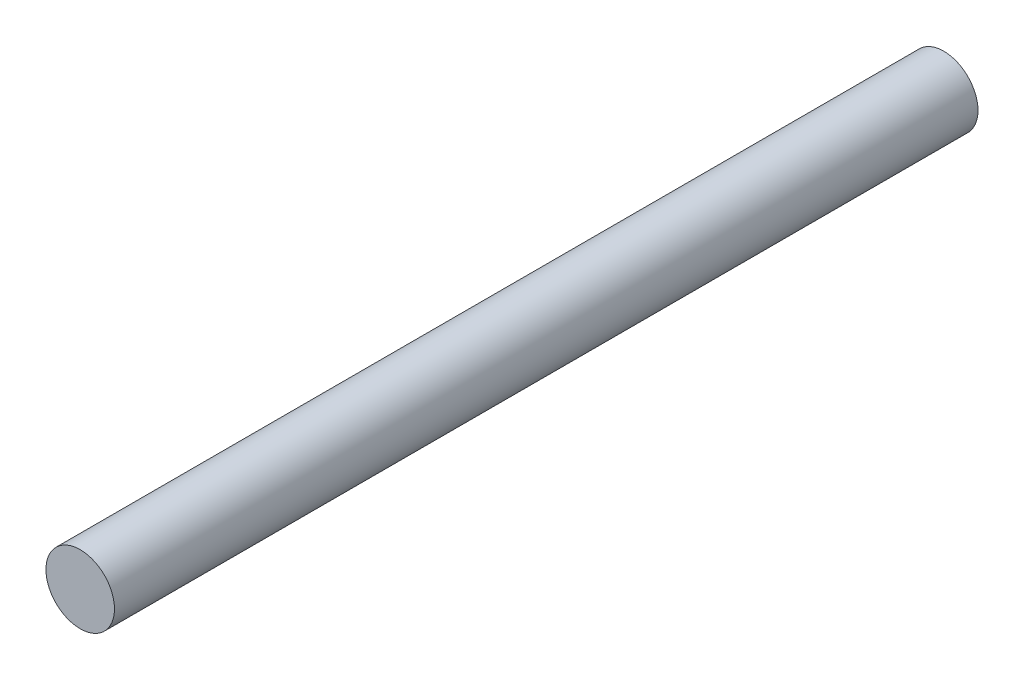
ISO-10303-21;
HEADER;
FILE_DESCRIPTION(('STEP AP214'),'2;1');
FILE_NAME('part.step','',(''),(''),'','','');
FILE_SCHEMA(('AUTOMOTIVE_DESIGN { 1 0 10303 214 1 1 1 1 }'));
ENDSEC;
DATA;
#1=APPLICATION_CONTEXT('core data for automotive mechanical design processes');
#2=APPLICATION_PROTOCOL_DEFINITION('international standard','automotive_design',2000,#1);
#3=PRODUCT_CONTEXT('',#1,'mechanical');
#4=PRODUCT('Part','Part','',(#3));
#5=PRODUCT_RELATED_PRODUCT_CATEGORY('part','',(#4));
#6=PRODUCT_DEFINITION_FORMATION('','',#4);
#7=PRODUCT_DEFINITION_CONTEXT('part definition',#1,'design');
#8=PRODUCT_DEFINITION('design','',#6,#7);
#9=PRODUCT_DEFINITION_SHAPE('','',#8);
#10=(LENGTH_UNIT() NAMED_UNIT(*) SI_UNIT(.MILLI.,.METRE.));
#11=(NAMED_UNIT(*) PLANE_ANGLE_UNIT() SI_UNIT($,.RADIAN.));
#12=(NAMED_UNIT(*) SI_UNIT($,.STERADIAN.) SOLID_ANGLE_UNIT());
#13=UNCERTAINTY_MEASURE_WITH_UNIT(LENGTH_MEASURE(1.E-05),#10,'distance_accuracy_value','');
#14=(GEOMETRIC_REPRESENTATION_CONTEXT(3) GLOBAL_UNCERTAINTY_ASSIGNED_CONTEXT((#13)) GLOBAL_UNIT_ASSIGNED_CONTEXT((#10,
#11,#12)) REPRESENTATION_CONTEXT('',''));
#15=CARTESIAN_POINT('',(0.,0.,0.));
#16=DIRECTION('',(0.,0.,1.));
#17=DIRECTION('',(1.,0.,0.));
#18=AXIS2_PLACEMENT_3D('',#15,#16,#17);
#19=CARTESIAN_POINT('',(0.,0.,120.));
#20=DIRECTION('',(0.,0.,-1.));
#21=DIRECTION('',(-1.,0.,0.));
#22=AXIS2_PLACEMENT_3D('',#19,#20,#21);
#23=CYLINDRICAL_SURFACE('',#22,4.7625);
#24=CARTESIAN_POINT('',(0.,0.,120.));
#25=DIRECTION('',(0.,0.,1.));
#26=DIRECTION('',(1.,0.,0.));
#27=AXIS2_PLACEMENT_3D('',#24,#25,#26);
#28=CIRCLE('',#27,4.7625);
#29=CARTESIAN_POINT('',(4.7625,0.,120.));
#30=VERTEX_POINT('',#29);
#31=EDGE_CURVE('E10',#30,#30,#28,.T.);
#32=ORIENTED_EDGE('',*,*,#31,.F.);
#33=EDGE_LOOP('',(#32));
#34=FACE_BOUND('',#33,.T.);
#35=CARTESIAN_POINT('',(0.,0.,0.));
#36=DIRECTION('',(0.,0.,1.));
#37=DIRECTION('',(1.,0.,0.));
#38=AXIS2_PLACEMENT_3D('',#35,#36,#37);
#39=CIRCLE('',#38,4.7625);
#40=CARTESIAN_POINT('',(4.7625,0.,0.));
#41=VERTEX_POINT('',#40);
#42=EDGE_CURVE('E36',#41,#41,#39,.T.);
#43=ORIENTED_EDGE('',*,*,#42,.T.);
#44=EDGE_LOOP('',(#43));
#45=FACE_BOUND('',#44,.T.);
#46=ADVANCED_FACE('F33',(#34,#45),#23,.T.);
#47=CARTESIAN_POINT('',(0.,0.,120.));
#48=DIRECTION('',(0.,0.,1.));
#49=DIRECTION('',(1.,0.,0.));
#50=AXIS2_PLACEMENT_3D('',#47,#48,#49);
#51=PLANE('',#50);
#52=ORIENTED_EDGE('',*,*,#31,.T.);
#53=EDGE_LOOP('',(#52));
#54=FACE_BOUND('',#53,.T.);
#55=ADVANCED_FACE('F48',(#54),#51,.T.);
#56=CARTESIAN_POINT('',(0.,0.,0.));
#57=DIRECTION('',(0.,0.,1.));
#58=DIRECTION('',(1.,0.,0.));
#59=AXIS2_PLACEMENT_3D('',#56,#57,#58);
#60=PLANE('',#59);
#61=ORIENTED_EDGE('',*,*,#42,.F.);
#62=EDGE_LOOP('',(#61));
#63=FACE_BOUND('',#62,.T.);
#64=ADVANCED_FACE('F46',(#63),#60,.F.);
#65=CLOSED_SHELL('',(#46,#55,#64));
#66=MANIFOLD_SOLID_BREP('B2',#65);
#67=ADVANCED_BREP_SHAPE_REPRESENTATION('',(#18,#66),#14);
#68=SHAPE_DEFINITION_REPRESENTATION(#9,#67);
ENDSEC;
END-ISO-10303-21;
